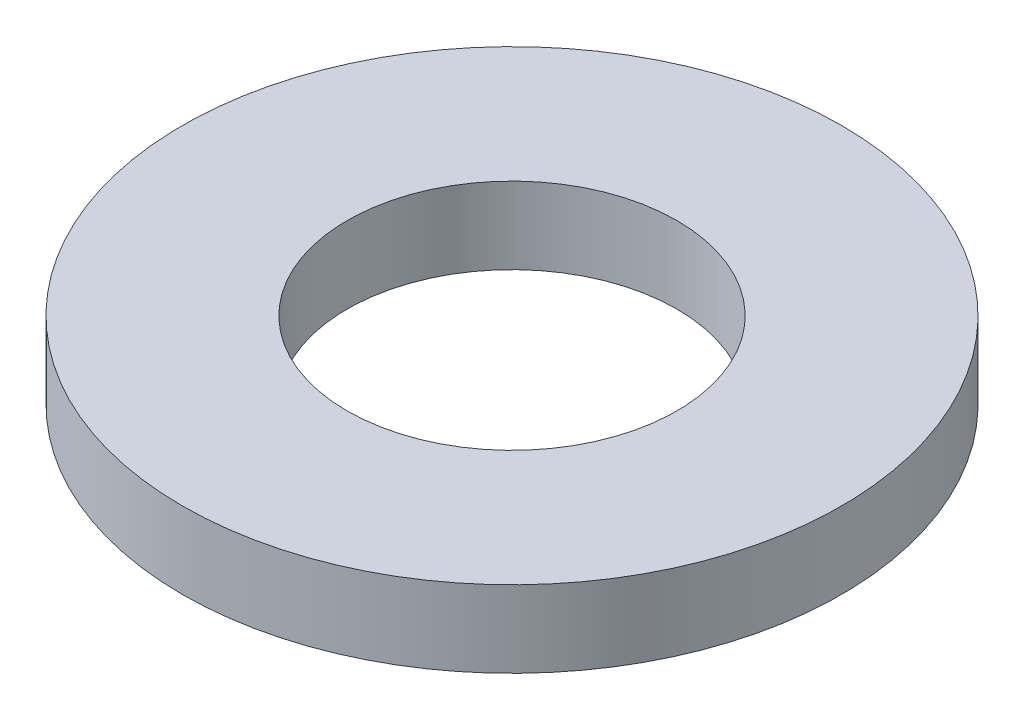
ISO-10303-21;
HEADER;
FILE_DESCRIPTION(('STEP AP214'),'2;1');
FILE_NAME('part.step','',(''),(''),'','','');
FILE_SCHEMA(('AUTOMOTIVE_DESIGN { 1 0 10303 214 1 1 1 1 }'));
ENDSEC;
DATA;
#1=APPLICATION_CONTEXT('core data for automotive mechanical design processes');
#2=APPLICATION_PROTOCOL_DEFINITION('international standard','automotive_design',2000,#1);
#3=PRODUCT_CONTEXT('',#1,'mechanical');
#4=PRODUCT('Part','Part','',(#3));
#5=PRODUCT_RELATED_PRODUCT_CATEGORY('part','',(#4));
#6=PRODUCT_DEFINITION_FORMATION('','',#4);
#7=PRODUCT_DEFINITION_CONTEXT('part definition',#1,'design');
#8=PRODUCT_DEFINITION('design','',#6,#7);
#9=PRODUCT_DEFINITION_SHAPE('','',#8);
#10=(LENGTH_UNIT() NAMED_UNIT(*) SI_UNIT(.MILLI.,.METRE.));
#11=(NAMED_UNIT(*) PLANE_ANGLE_UNIT() SI_UNIT($,.RADIAN.));
#12=(NAMED_UNIT(*) SI_UNIT($,.STERADIAN.) SOLID_ANGLE_UNIT());
#13=UNCERTAINTY_MEASURE_WITH_UNIT(LENGTH_MEASURE(1.E-05),#10,'distance_accuracy_value','');
#14=(GEOMETRIC_REPRESENTATION_CONTEXT(3) GLOBAL_UNCERTAINTY_ASSIGNED_CONTEXT((#13)) GLOBAL_UNIT_ASSIGNED_CONTEXT((#10,
#11,#12)) REPRESENTATION_CONTEXT('',''));
#15=CARTESIAN_POINT('',(0.,0.,0.));
#16=DIRECTION('',(0.,0.,1.));
#17=DIRECTION('',(1.,0.,0.));
#18=AXIS2_PLACEMENT_3D('',#15,#16,#17);
#19=CARTESIAN_POINT('',(0.,2.032,0.));
#20=DIRECTION('',(0.,-1.,0.));
#21=DIRECTION('',(0.,0.,-1.));
#22=AXIS2_PLACEMENT_3D('',#19,#20,#21);
#23=CYLINDRICAL_SURFACE('',#22,8.73125);
#24=CARTESIAN_POINT('',(0.,2.032,0.));
#25=DIRECTION('',(0.,1.,0.));
#26=DIRECTION('',(0.,0.,1.));
#27=AXIS2_PLACEMENT_3D('',#24,#25,#26);
#28=CIRCLE('',#27,8.73125);
#29=CARTESIAN_POINT('',(0.,2.032,8.73125));
#30=VERTEX_POINT('',#29);
#31=EDGE_CURVE('E10',#30,#30,#28,.T.);
#32=ORIENTED_EDGE('',*,*,#31,.F.);
#33=EDGE_LOOP('',(#32));
#34=FACE_BOUND('',#33,.T.);
#35=CARTESIAN_POINT('',(0.,0.,0.));
#36=DIRECTION('',(0.,1.,0.));
#37=DIRECTION('',(0.,0.,1.));
#38=AXIS2_PLACEMENT_3D('',#35,#36,#37);
#39=CIRCLE('',#38,8.73125);
#40=CARTESIAN_POINT('',(0.,0.,8.73125));
#41=VERTEX_POINT('',#40);
#42=EDGE_CURVE('E33',#41,#41,#39,.T.);
#43=ORIENTED_EDGE('',*,*,#42,.T.);
#44=EDGE_LOOP('',(#43));
#45=FACE_BOUND('',#44,.T.);
#46=ADVANCED_FACE('F30',(#34,#45),#23,.T.);
#47=CARTESIAN_POINT('',(0.,2.032,0.));
#48=DIRECTION('',(0.,1.,0.));
#49=DIRECTION('',(0.,0.,1.));
#50=AXIS2_PLACEMENT_3D('',#47,#48,#49);
#51=PLANE('',#50);
#52=CARTESIAN_POINT('',(0.,2.032,0.));
#53=DIRECTION('',(0.,1.,0.));
#54=DIRECTION('',(0.,0.,1.));
#55=AXIS2_PLACEMENT_3D('',#52,#53,#54);
#56=CIRCLE('',#55,4.3688);
#57=CARTESIAN_POINT('',(0.,2.032,4.3688));
#58=VERTEX_POINT('',#57);
#59=EDGE_CURVE('E42',#58,#58,#56,.T.);
#60=ORIENTED_EDGE('',*,*,#59,.F.);
#61=EDGE_LOOP('',(#60));
#62=FACE_BOUND('',#61,.T.);
#63=ORIENTED_EDGE('',*,*,#31,.T.);
#64=EDGE_LOOP('',(#63));
#65=FACE_BOUND('',#64,.T.);
#66=ADVANCED_FACE('F57',(#62,#65),#51,.T.);
#67=CARTESIAN_POINT('',(0.,0.,0.));
#68=DIRECTION('',(0.,1.,0.));
#69=DIRECTION('',(0.,0.,1.));
#70=AXIS2_PLACEMENT_3D('',#67,#68,#69);
#71=PLANE('',#70);
#72=CARTESIAN_POINT('',(0.,0.,0.));
#73=DIRECTION('',(0.,1.,0.));
#74=DIRECTION('',(0.,0.,1.));
#75=AXIS2_PLACEMENT_3D('',#72,#73,#74);
#76=CIRCLE('',#75,4.3688);
#77=CARTESIAN_POINT('',(0.,0.,4.3688));
#78=VERTEX_POINT('',#77);
#79=EDGE_CURVE('E40',#78,#78,#76,.T.);
#80=ORIENTED_EDGE('',*,*,#79,.T.);
#81=EDGE_LOOP('',(#80));
#82=FACE_BOUND('',#81,.T.);
#83=ORIENTED_EDGE('',*,*,#42,.F.);
#84=EDGE_LOOP('',(#83));
#85=FACE_BOUND('',#84,.T.);
#86=ADVANCED_FACE('F48',(#82,#85),#71,.F.);
#87=CARTESIAN_POINT('',(0.,0.,0.));
#88=DIRECTION('',(0.,1.,0.));
#89=DIRECTION('',(0.,0.,1.));
#90=AXIS2_PLACEMENT_3D('',#87,#88,#89);
#91=CYLINDRICAL_SURFACE('',#90,4.3688);
#92=ORIENTED_EDGE('',*,*,#79,.F.);
#93=EDGE_LOOP('',(#92));
#94=FACE_BOUND('',#93,.T.);
#95=ORIENTED_EDGE('',*,*,#59,.T.);
#96=EDGE_LOOP('',(#95));
#97=FACE_BOUND('',#96,.T.);
#98=ADVANCED_FACE('F51',(#94,#97),#91,.F.);
#99=CLOSED_SHELL('',(#46,#66,#86,#98));
#100=MANIFOLD_SOLID_BREP('B2',#99);
#101=ADVANCED_BREP_SHAPE_REPRESENTATION('',(#18,#100),#14);
#102=SHAPE_DEFINITION_REPRESENTATION(#9,#101);
ENDSEC;
END-ISO-10303-21;
